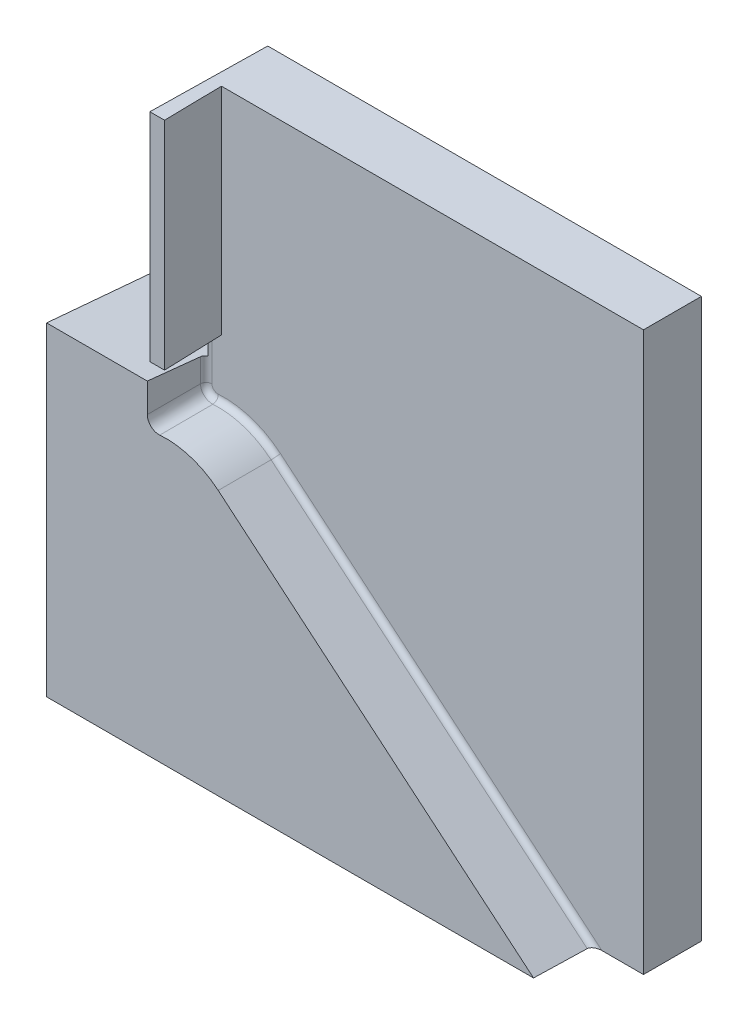
ISO-10303-21;
HEADER;
FILE_DESCRIPTION(('STEP AP214'),'2;1');
FILE_NAME('part.step','',(''),(''),'','','');
FILE_SCHEMA(('AUTOMOTIVE_DESIGN { 1 0 10303 214 1 1 1 1 }'));
ENDSEC;
DATA;
#1=APPLICATION_CONTEXT('core data for automotive mechanical design processes');
#2=APPLICATION_PROTOCOL_DEFINITION('international standard','automotive_design',2000,#1);
#3=PRODUCT_CONTEXT('',#1,'mechanical');
#4=PRODUCT('Part','Part','',(#3));
#5=PRODUCT_RELATED_PRODUCT_CATEGORY('part','',(#4));
#6=PRODUCT_DEFINITION_FORMATION('','',#4);
#7=PRODUCT_DEFINITION_CONTEXT('part definition',#1,'design');
#8=PRODUCT_DEFINITION('design','',#6,#7);
#9=PRODUCT_DEFINITION_SHAPE('','',#8);
#10=(LENGTH_UNIT() NAMED_UNIT(*) SI_UNIT(.MILLI.,.METRE.));
#11=(NAMED_UNIT(*) PLANE_ANGLE_UNIT() SI_UNIT($,.RADIAN.));
#12=(NAMED_UNIT(*) SI_UNIT($,.STERADIAN.) SOLID_ANGLE_UNIT());
#13=UNCERTAINTY_MEASURE_WITH_UNIT(LENGTH_MEASURE(1.E-05),#10,'distance_accuracy_value','');
#14=(GEOMETRIC_REPRESENTATION_CONTEXT(3) GLOBAL_UNCERTAINTY_ASSIGNED_CONTEXT((#13)) GLOBAL_UNIT_ASSIGNED_CONTEXT((#10,
#11,#12)) REPRESENTATION_CONTEXT('',''));
#15=CARTESIAN_POINT('',(0.,0.,0.));
#16=DIRECTION('',(0.,0.,1.));
#17=DIRECTION('',(1.,0.,0.));
#18=AXIS2_PLACEMENT_3D('',#15,#16,#17);
#19=CARTESIAN_POINT('',(0.,0.,10.));
#20=DIRECTION('',(0.,0.,1.));
#21=DIRECTION('',(1.,0.,0.));
#22=AXIS2_PLACEMENT_3D('',#19,#20,#21);
#23=PLANE('',#22);
#24=DIRECTION('',(-1.,0.,0.));
#25=VECTOR('',#24,1.);
#26=CARTESIAN_POINT('',(0.,10.4776428395734,10.));
#27=LINE('',#26,#25);
#28=CARTESIAN_POINT('',(-10.3127094384121,10.4776428395734,10.));
#29=VERTEX_POINT('',#28);
#30=CARTESIAN_POINT('',(-1.62,10.4776428395734,10.));
#31=VERTEX_POINT('',#30);
#32=EDGE_CURVE('E212',#29,#31,#27,.F.);
#33=ORIENTED_EDGE('',*,*,#32,.F.);
#34=DIRECTION('',(0.,-1.,0.));
#35=VECTOR('',#34,1.);
#36=CARTESIAN_POINT('',(-10.3127094384121,30.7179323600997,10.));
#37=LINE('',#36,#35);
#38=CARTESIAN_POINT('',(-10.3127094384121,-17.472327885701,10.));
#39=VERTEX_POINT('',#38);
#40=EDGE_CURVE('E367',#29,#39,#37,.T.);
#41=ORIENTED_EDGE('',*,*,#40,.T.);
#42=DIRECTION('',(1.,0.,0.));
#43=VECTOR('',#42,1.);
#44=CARTESIAN_POINT('',(-10.3127094384121,-17.472327885701,10.));
#45=LINE('',#44,#43);
#46=CARTESIAN_POINT('',(31.7127763167912,-17.472327885701,10.));
#47=VERTEX_POINT('',#46);
#48=EDGE_CURVE('E184',#39,#47,#45,.T.);
#49=ORIENTED_EDGE('',*,*,#48,.T.);
#50=DIRECTION('',(0.766044443118979,-0.642787609686538,0.));
#51=VECTOR('',#50,1.);
#52=CARTESIAN_POINT('',(4.49951326780577,5.36231110183286,10.));
#53=LINE('',#52,#51);
#54=CARTESIAN_POINT('',(4.49951326780577,5.36231110183285,10.));
#55=VERTEX_POINT('',#54);
#56=EDGE_CURVE('E208',#55,#47,#53,.T.);
#57=ORIENTED_EDGE('',*,*,#56,.F.);
#58=CARTESIAN_POINT('',(0.,0.,10.));
#59=DIRECTION('',(0.,0.,-1.));
#60=DIRECTION('',(1.,0.,0.));
#61=AXIS2_PLACEMENT_3D('',#58,#59,#60);
#62=CIRCLE('',#61,7.);
#63=CARTESIAN_POINT('',(-0.542643597644193,6.97893530031163,10.));
#64=VERTEX_POINT('',#63);
#65=EDGE_CURVE('E382',#64,#55,#62,.T.);
#66=ORIENTED_EDGE('',*,*,#65,.F.);
#67=CARTESIAN_POINT('',(-1.86226192819603,7.70949924589118,23.879176570944));
#68=CARTESIAN_POINT('',(-1.861881352247,6.59199390698618,23.8573733894266));
#69=CARTESIAN_POINT('',(-0.751260723548677,6.71584925175975,23.879176570944));
#70=CARTESIAN_POINT('',(-1.81468561428221,7.76269332908506,21.1535313722884));
#71=CARTESIAN_POINT('',(-1.81449061841132,6.65266247599894,21.1423600663269));
#72=CARTESIAN_POINT('',(-0.710497885203577,6.76828146759619,21.1535313722883));
#73=CARTESIAN_POINT('',(-1.76710911409322,7.81533916917287,18.4278755019356));
#74=CARTESIAN_POINT('',(-1.7669109798216,6.71279004661341,18.4165243971166));
#75=CARTESIAN_POINT('',(-0.66960984213034,6.82024975175268,18.4278755019355));
#76=CARTESIAN_POINT('',(-1.67195577395729,7.91959456815973,12.9765442965094));
#77=CARTESIAN_POINT('',(-1.67176669079631,6.8315467485382,12.965711729472));
#78=CARTESIAN_POINT('',(-0.587596004025211,6.92330304309015,12.9765442965093));
#79=CARTESIAN_POINT('',(-1.62437893401039,7.97120412719243,10.2508689614386));
#80=CARTESIAN_POINT('',(-1.62418589699077,6.89020664437266,10.2398098779916));
#81=CARTESIAN_POINT('',(-0.546470209023985,6.97438805038506,10.2508689614386));
#82=CARTESIAN_POINT('',(-1.52922493552314,8.07344718209033,4.7995000390909));
#83=CARTESIAN_POINT('',(-1.52903969228548,7.00612895866886,4.78888746111288));
#84=CARTESIAN_POINT('',(-0.463993514597806,7.07571938719937,4.79950003909091));
#85=CARTESIAN_POINT('',(-1.4816477769828,8.12408067796876,2.07380645181429));
#86=CARTESIAN_POINT('',(-1.48145944898192,7.06341879520625,2.06301714786963));
#87=CARTESIAN_POINT('',(-0.422642615175904,7.12596571673015,2.07380645181428));
#88=CARTESIAN_POINT('',(-1.38649315696092,8.2244237690955,-3.37759807822863));
#89=CARTESIAN_POINT('',(-1.38631168146097,7.17669363550962,-3.38799480265756));
#90=CARTESIAN_POINT('',(-0.33972707872638,7.22565877196112,-3.37759807822866));
#91=CARTESIAN_POINT('',(-1.33891569547934,8.27413336422466,-6.10330902099713));
#92=CARTESIAN_POINT('',(-1.33873046314048,7.2327032195496,-6.11392097458327));
#93=CARTESIAN_POINT('',(-0.298162441671193,7.27510549755819,-6.10330902099716));
#94=CARTESIAN_POINT('',(-1.29133809681156,8.32340708336826,-8.82902782315814));
#95=CARTESIAN_POINT('',(-1.29101157297209,7.28826937948639,-8.8477343613927));
#96=CARTESIAN_POINT('',(-0.256496624819869,7.32417195133359,-8.82902782315814));
#97=(BOUNDED_SURFACE() B_SPLINE_SURFACE(3,2,((#67,#68,#69),(#70,#71,#72),(#73,#74,#75),(#76,#77,
#78),(#79,#80,#81),(#82,#83,#84),(#85,#86,#87),(#88,#89,#90),(#91,#92,#93),(#94,#95,#96)),
.UNSPECIFIED.,.F.,.F.,.F.) B_SPLINE_SURFACE_WITH_KNOTS((4,2,2,2,4),(3,3),(0.,8.17973791160612,
16.3594747681815,24.5392115138579,32.7189493144313),(0.,1.),
.UNSPECIFIED.) GEOMETRIC_REPRESENTATION_ITEM() RATIONAL_B_SPLINE_SURFACE(((1.,0.666771327449439,
1.),(1.,0.669325498178683,1.),(1.,0.671818310341544,1.),(1.,0.676689481925855,1.),(1.,
0.679067841362067,1.),(1.,0.683718372507526,1.),(1.,0.685990544218211,1.),(1.,0.690435799295334,
1.),(1.,0.692608882648993,1.),(1.,0.694735971206638,1.))) REPRESENTATION_ITEM('') SURFACE());
#98=CARTESIAN_POINT('',(-0.542643597644193,6.97893530031163,10.));
#99=CARTESIAN_POINT('',(-0.570692909111427,6.9767545776183,10.));
#100=CARTESIAN_POINT('',(-0.598820842995149,6.97575871372237,10.));
#101=CARTESIAN_POINT('',(-0.655059370866384,6.97613825153809,10.));
#102=CARTESIAN_POINT('',(-0.683169965594433,6.97751354378452,10.));
#103=CARTESIAN_POINT('',(-0.767124084031438,6.98518977014603,10.));
#104=CARTESIAN_POINT('',(-0.822684918764359,6.99503376307722,10.));
#105=CARTESIAN_POINT('',(-0.931363695211913,7.02391035824553,10.));
#106=CARTESIAN_POINT('',(-0.98448044298687,7.04294740018397,10.));
#107=CARTESIAN_POINT('',(-1.08676348279268,7.08966883624479,10.));
#108=CARTESIAN_POINT('',(-1.13593032005199,7.11735203430202,10.));
#109=CARTESIAN_POINT('',(-1.22890789438271,7.18057638982659,10.));
#110=CARTESIAN_POINT('',(-1.27271945003591,7.21611634401076,10.));
#111=CARTESIAN_POINT('',(-1.35375663913103,7.29405036181978,10.));
#112=CARTESIAN_POINT('',(-1.39098189678914,7.33644481626689,10.));
#113=CARTESIAN_POINT('',(-1.45778182021727,7.42687646050034,10.));
#114=CARTESIAN_POINT('',(-1.48735715536757,7.47491315604646,10.));
#115=CARTESIAN_POINT('',(-1.53802464669529,7.57527163235374,10.));
#116=CARTESIAN_POINT('',(-1.55911754319833,7.6275930386763,10.));
#117=CARTESIAN_POINT('',(-1.59033560094408,7.72891957902586,10.));
#118=CARTESIAN_POINT('',(-1.60143325847842,7.77762794740184,10.));
#119=CARTESIAN_POINT('',(-1.61627820058463,7.87614369368367,10.));
#120=CARTESIAN_POINT('',(-1.62002658649893,7.92595090578822,10.));
#121=CARTESIAN_POINT('',(-1.62,7.97577421097765,10.));
#122=B_SPLINE_CURVE_WITH_KNOTS('',3,(#98,#99,#100,#101,#102,#103,#104,#105,#106,#107,#108,#109,
#110,#111,#112,#113,#114,#115,#116,#117,#118,#119,#120,#121),.UNSPECIFIED.,.F.,.F.,(4,2,2,2,2,2,
2,2,2,2,2,4),(0.,0.0843500560753299,0.168696218205322,0.337106410305261,0.505598016073043,
0.674066323887255,0.842508848183622,1.01096097993723,1.17939836687337,1.34782104983163,
1.49714458743473,1.64644574609613),.UNSPECIFIED.);
#123=CARTESIAN_POINT('',(-1.62,7.97577421097765,10.));
#124=VERTEX_POINT('',#123);
#125=EDGE_CURVE('E279',#64,#124,#122,.T.);
#126=ORIENTED_EDGE('',*,*,#125,.T.);
#127=DIRECTION('',(0.,-1.,0.));
#128=VECTOR('',#127,1.);
#129=CARTESIAN_POINT('',(-1.62,11.78,10.));
#130=LINE('',#129,#128);
#131=EDGE_CURVE('E203',#31,#124,#130,.T.);
#132=ORIENTED_EDGE('',*,*,#131,.F.);
#133=EDGE_LOOP('',(#33,#41,#49,#57,#66,#126,#132));
#134=FACE_BOUND('',#133,.T.);
#135=ADVANCED_FACE('F35',(#134),#23,.T.);
#136=CARTESIAN_POINT('',(36.1992830376344,30.7179323600997,10.));
#137=DIRECTION('',(-1.,0.,0.));
#138=DIRECTION('',(0.,0.,1.));
#139=AXIS2_PLACEMENT_3D('',#136,#137,#138);
#140=PLANE('',#139);
#141=DIRECTION('',(0.,1.,0.));
#142=VECTOR('',#141,1.);
#143=CARTESIAN_POINT('',(36.1992830376344,30.7179323600997,5.));
#144=LINE('',#143,#142);
#145=CARTESIAN_POINT('',(36.1992830376344,-17.472327885701,5.));
#146=VERTEX_POINT('',#145);
#147=CARTESIAN_POINT('',(36.1992830376344,30.7179323600997,5.));
#148=VERTEX_POINT('',#147);
#149=EDGE_CURVE('E151',#146,#148,#144,.T.);
#150=ORIENTED_EDGE('',*,*,#149,.F.);
#151=DIRECTION('',(0.,0.,-1.));
#152=VECTOR('',#151,1.);
#153=CARTESIAN_POINT('',(36.1992830376344,-17.472327885701,10.));
#154=LINE('',#153,#152);
#155=CARTESIAN_POINT('',(36.1992830376344,-17.472327885701,0.));
#156=VERTEX_POINT('',#155);
#157=EDGE_CURVE('E178',#146,#156,#154,.T.);
#158=ORIENTED_EDGE('',*,*,#157,.T.);
#159=DIRECTION('',(0.,1.,0.));
#160=VECTOR('',#159,1.);
#161=CARTESIAN_POINT('',(36.1992830376344,30.7179323600997,0.));
#162=LINE('',#161,#160);
#163=CARTESIAN_POINT('',(36.1992830376344,30.7179323600997,0.));
#164=VERTEX_POINT('',#163);
#165=EDGE_CURVE('E176',#156,#164,#162,.T.);
#166=ORIENTED_EDGE('',*,*,#165,.T.);
#167=DIRECTION('',(0.,0.,-1.));
#168=VECTOR('',#167,1.);
#169=CARTESIAN_POINT('',(36.1992830376344,30.7179323600997,10.));
#170=LINE('',#169,#168);
#171=EDGE_CURVE('E168',#148,#164,#170,.T.);
#172=ORIENTED_EDGE('',*,*,#171,.F.);
#173=EDGE_LOOP('',(#150,#158,#166,#172));
#174=FACE_BOUND('',#173,.T.);
#175=ADVANCED_FACE('F174',(#174),#140,.F.);
#176=CARTESIAN_POINT('',(-10.3127094384121,30.7179323600997,10.));
#177=DIRECTION('',(1.,0.,0.));
#178=DIRECTION('',(0.,0.,-1.));
#179=AXIS2_PLACEMENT_3D('',#176,#177,#178);
#180=PLANE('',#179);
#181=ORIENTED_EDGE('',*,*,#40,.F.);
#182=DIRECTION('',(0.,-0.0871557427476584,-0.996194698091746));
#183=VECTOR('',#182,1.);
#184=CARTESIAN_POINT('',(-10.3127094384121,11.58,22.6));
#185=LINE('',#184,#183);
#186=CARTESIAN_POINT('',(-10.3127094384121,9.60275620431411,0.));
#187=VERTEX_POINT('',#186);
#188=EDGE_CURVE('E215',#187,#29,#185,.F.);
#189=ORIENTED_EDGE('',*,*,#188,.F.);
#190=DIRECTION('',(0.,-1.,0.));
#191=VECTOR('',#190,1.);
#192=CARTESIAN_POINT('',(-10.3127094384121,30.7179323600997,0.));
#193=LINE('',#192,#191);
#194=CARTESIAN_POINT('',(-10.3127094384121,-17.472327885701,0.));
#195=VERTEX_POINT('',#194);
#196=EDGE_CURVE('E360',#187,#195,#193,.T.);
#197=ORIENTED_EDGE('',*,*,#196,.T.);
#198=DIRECTION('',(0.,0.,-1.));
#199=VECTOR('',#198,1.);
#200=CARTESIAN_POINT('',(-10.3127094384121,-17.472327885701,10.));
#201=LINE('',#200,#199);
#202=EDGE_CURVE('E181',#39,#195,#201,.T.);
#203=ORIENTED_EDGE('',*,*,#202,.F.);
#204=EDGE_LOOP('',(#181,#189,#197,#203));
#205=FACE_BOUND('',#204,.T.);
#206=ADVANCED_FACE('F334',(#205),#180,.F.);
#207=CARTESIAN_POINT('',(-10.3127094384121,-17.472327885701,10.));
#208=DIRECTION('',(0.,1.,0.));
#209=DIRECTION('',(0.,0.,1.));
#210=AXIS2_PLACEMENT_3D('',#207,#208,#209);
#211=PLANE('',#210);
#212=DIRECTION('',(1.,0.,0.));
#213=VECTOR('',#212,1.);
#214=CARTESIAN_POINT('',(-10.3127094384121,-17.472327885701,5.));
#215=LINE('',#214,#213);
#216=CARTESIAN_POINT('',(32.6129553922421,-17.472327885701,5.));
#217=VERTEX_POINT('',#216);
#218=EDGE_CURVE('E158',#217,#146,#215,.T.);
#219=ORIENTED_EDGE('',*,*,#218,.F.);
#220=CARTESIAN_POINT('',(32.6129553922421,-17.472327885701,5.5));
#221=DIRECTION('',(0.,1.,0.));
#222=DIRECTION('',(-1.,0.,0.));
#223=AXIS2_PLACEMENT_3D('',#220,#221,#222);
#224=ELLIPSE('',#223,0.777861913430208,0.5);
#225=CARTESIAN_POINT('',(31.835211950949,-17.472327885701,5.49127379678136));
#226=VERTEX_POINT('',#225);
#227=EDGE_CURVE('E11',#217,#226,#224,.T.);
#228=ORIENTED_EDGE('',*,*,#227,.T.);
#229=DIRECTION('',(0.02714525368675,0.,-0.999631499704907));
#230=VECTOR('',#229,1.);
#231=CARTESIAN_POINT('',(31.6818092157312,-17.472327885701,11.1403720897713));
#232=LINE('',#231,#230);
#233=EDGE_CURVE('E193',#226,#47,#232,.F.);
#234=ORIENTED_EDGE('',*,*,#233,.T.);
#235=ORIENTED_EDGE('',*,*,#48,.F.);
#236=ORIENTED_EDGE('',*,*,#202,.T.);
#237=DIRECTION('',(1.,0.,0.));
#238=VECTOR('',#237,1.);
#239=CARTESIAN_POINT('',(-10.3127094384121,-17.472327885701,0.));
#240=LINE('',#239,#238);
#241=EDGE_CURVE('E376',#195,#156,#240,.T.);
#242=ORIENTED_EDGE('',*,*,#241,.T.);
#243=ORIENTED_EDGE('',*,*,#157,.F.);
#244=EDGE_LOOP('',(#219,#228,#234,#235,#236,#242,#243));
#245=FACE_BOUND('',#244,.T.);
#246=ADVANCED_FACE('F347',(#245),#211,.F.);
#247=CARTESIAN_POINT('',(-10.3127094384121,30.7179323600997,10.));
#248=DIRECTION('',(0.,-1.,0.));
#249=DIRECTION('',(0.,0.,-1.));
#250=AXIS2_PLACEMENT_3D('',#247,#248,#249);
#251=PLANE('',#250);
#252=DIRECTION('',(-1.,0.,0.));
#253=VECTOR('',#252,1.);
#254=CARTESIAN_POINT('',(-10.3127094384121,30.7179323600997,0.));
#255=LINE('',#254,#253);
#256=CARTESIAN_POINT('',(-1.22551553262228,30.7179323600997,0.));
#257=VERTEX_POINT('',#256);
#258=EDGE_CURVE('E187',#164,#257,#255,.T.);
#259=ORIENTED_EDGE('',*,*,#258,.T.);
#260=DIRECTION('',(0.0174524064372835,0.,-0.999847695156391));
#261=VECTOR('',#260,1.);
#262=CARTESIAN_POINT('',(-1.40278085263461,30.7179323600997,10.1555233819705));
#263=LINE('',#262,#261);
#264=CARTESIAN_POINT('',(-1.40006618190446,30.7179323600997,10.));
#265=VERTEX_POINT('',#264);
#266=EDGE_CURVE('E217',#257,#265,#263,.F.);
#267=ORIENTED_EDGE('',*,*,#266,.T.);
#268=DIRECTION('',(-1.,0.,0.));
#269=VECTOR('',#268,1.);
#270=CARTESIAN_POINT('',(-10.3127094384121,30.7179323600997,10.));
#271=LINE('',#270,#269);
#272=CARTESIAN_POINT('',(-0.134843947951976,30.7179323600997,10.));
#273=VERTEX_POINT('',#272);
#274=EDGE_CURVE('E179',#273,#265,#271,.T.);
#275=ORIENTED_EDGE('',*,*,#274,.F.);
#276=DIRECTION('',(-0.0174524064372835,0.,-0.999847695156391));
#277=VECTOR('',#276,1.);
#278=CARTESIAN_POINT('',(0.12,30.7179323600997,24.6));
#279=LINE('',#278,#277);
#280=CARTESIAN_POINT('',(-0.222119272593065,30.7179323600997,5.));
#281=VERTEX_POINT('',#280);
#282=EDGE_CURVE('E171',#281,#273,#279,.F.);
#283=ORIENTED_EDGE('',*,*,#282,.F.);
#284=DIRECTION('',(-1.,0.,0.));
#285=VECTOR('',#284,1.);
#286=CARTESIAN_POINT('',(0.12,30.7179323600997,5.));
#287=LINE('',#286,#285);
#288=EDGE_CURVE('E156',#148,#281,#287,.T.);
#289=ORIENTED_EDGE('',*,*,#288,.F.);
#290=ORIENTED_EDGE('',*,*,#171,.T.);
#291=EDGE_LOOP('',(#259,#267,#275,#283,#289,#290));
#292=FACE_BOUND('',#291,.T.);
#293=ADVANCED_FACE('F167',(#292),#251,.F.);
#294=DIRECTION('',(0.,-1.,0.));
#295=VECTOR('',#294,1.);
#296=CARTESIAN_POINT('',(-1.40006618190446,0.,10.));
#297=LINE('',#296,#295);
#298=CARTESIAN_POINT('',(-1.40006618190446,12.034843947952,10.));
#299=VERTEX_POINT('',#298);
#300=EDGE_CURVE('E204',#299,#265,#297,.F.);
#301=ORIENTED_EDGE('',*,*,#300,.F.);
#302=DIRECTION('',(1.,0.,0.));
#303=VECTOR('',#302,1.);
#304=CARTESIAN_POINT('',(0.,12.034843947952,10.));
#305=LINE('',#304,#303);
#306=CARTESIAN_POINT('',(-0.134843947951977,12.034843947952,10.));
#307=VERTEX_POINT('',#306);
#308=EDGE_CURVE('E200',#307,#299,#305,.F.);
#309=ORIENTED_EDGE('',*,*,#308,.F.);
#310=DIRECTION('',(0.,1.,0.));
#311=VECTOR('',#310,1.);
#312=CARTESIAN_POINT('',(-0.134843947951977,0.,10.));
#313=LINE('',#312,#311);
#314=EDGE_CURVE('E205',#273,#307,#313,.F.);
#315=ORIENTED_EDGE('',*,*,#314,.F.);
#316=ORIENTED_EDGE('',*,*,#274,.T.);
#317=EDGE_LOOP('',(#301,#309,#315,#316));
#318=FACE_BOUND('',#317,.T.);
#319=ADVANCED_FACE('F330',(#318),#23,.T.);
#320=CARTESIAN_POINT('',(0.,0.,0.));
#321=DIRECTION('',(0.,0.,1.));
#322=DIRECTION('',(1.,0.,0.));
#323=AXIS2_PLACEMENT_3D('',#320,#321,#322);
#324=PLANE('',#323);
#325=ORIENTED_EDGE('',*,*,#196,.F.);
#326=DIRECTION('',(-1.,0.,0.));
#327=VECTOR('',#326,1.);
#328=CARTESIAN_POINT('',(0.,9.60275620431411,0.));
#329=LINE('',#328,#327);
#330=CARTESIAN_POINT('',(-1.22551553262228,9.60275620431411,0.));
#331=VERTEX_POINT('',#330);
#332=EDGE_CURVE('E218',#187,#331,#329,.F.);
#333=ORIENTED_EDGE('',*,*,#332,.T.);
#334=DIRECTION('',(0.,-1.,0.));
#335=VECTOR('',#334,1.);
#336=CARTESIAN_POINT('',(-1.22551553262228,0.,0.));
#337=LINE('',#336,#335);
#338=EDGE_CURVE('E221',#331,#257,#337,.F.);
#339=ORIENTED_EDGE('',*,*,#338,.T.);
#340=ORIENTED_EDGE('',*,*,#258,.F.);
#341=ORIENTED_EDGE('',*,*,#165,.F.);
#342=ORIENTED_EDGE('',*,*,#241,.F.);
#343=EDGE_LOOP('',(#325,#333,#339,#340,#341,#342));
#344=FACE_BOUND('',#343,.T.);
#345=ADVANCED_FACE('F340',(#344),#324,.F.);
#346=CARTESIAN_POINT('',(0.,0.,5.));
#347=DIRECTION('',(0.,0.,1.));
#348=DIRECTION('',(1.,0.,0.));
#349=AXIS2_PLACEMENT_3D('',#346,#347,#348);
#350=PLANE('',#349);
#351=DIRECTION('',(1.,0.,0.));
#352=VECTOR('',#351,1.);
#353=CARTESIAN_POINT('',(0.,12.1221192725931,5.));
#354=LINE('',#353,#352);
#355=CARTESIAN_POINT('',(-0.222119272593065,12.1221192725931,5.));
#356=VERTEX_POINT('',#355);
#357=CARTESIAN_POINT('',(-1.04137604380107,12.1221192725931,5.));
#358=VERTEX_POINT('',#357);
#359=EDGE_CURVE('E162',#356,#358,#354,.F.);
#360=ORIENTED_EDGE('',*,*,#359,.T.);
#361=DIRECTION('',(0.,1.,0.));
#362=VECTOR('',#361,1.);
#363=CARTESIAN_POINT('',(-1.04137604380107,0.,5.));
#364=LINE('',#363,#362);
#365=CARTESIAN_POINT('',(-1.04137604380107,8.0603823815696,5.));
#366=VERTEX_POINT('',#365);
#367=EDGE_CURVE('E401',#358,#366,#364,.F.);
#368=ORIENTED_EDGE('',*,*,#367,.T.);
#369=CARTESIAN_POINT('',(-1.01317516197914,8.22595449932483,5.));
#370=CARTESIAN_POINT('',(-1.48015486364908,8.38977384845094,5.));
#371=CARTESIAN_POINT('',(-1.48496065149075,8.39145974835932,5.49485440592619));
#372=CARTESIAN_POINT('',(-1.0225128882221,8.19940881898319,5.));
#373=CARTESIAN_POINT('',(-1.49810369731091,8.33678620204255,5.));
#374=CARTESIAN_POINT('',(-1.50362460347094,8.33838066609241,5.49419630543603));
#375=CARTESIAN_POINT('',(-1.02956398056225,8.17206836761446,5.));
#376=CARTESIAN_POINT('',(-1.51151101724132,8.2822927883085,5.));
#377=CARTESIAN_POINT('',(-1.51771573139799,8.28371157807334,5.4935632847072));
#378=CARTESIAN_POINT('',(-1.03899301374549,8.11661253428494,5.));
#379=CARTESIAN_POINT('',(-1.52906836022451,8.17197698057451,5.));
#380=CARTESIAN_POINT('',(-1.5365528629387,8.17282229174521,5.49236431144039));
#381=CARTESIAN_POINT('',(-1.04137433616704,8.08849772803923,5.));
#382=CARTESIAN_POINT('',(-1.53323715325577,8.11614989472573,5.));
#383=CARTESIAN_POINT('',(-1.54130562886124,8.116603245765,5.49179831064973));
#384=CARTESIAN_POINT('',(-1.04137775142649,8.03226717677011,5.));
#385=CARTESIAN_POINT('',(-1.53221272998726,8.00467254235568,5.));
#386=CARTESIAN_POINT('',(-1.54129415395882,8.0041617240809,5.49074928742545));
#387=CARTESIAN_POINT('',(-1.03899986824554,8.00415143175213,5.));
#388=CARTESIAN_POINT('',(-1.52702911947367,7.94901292179014,5.));
#389=CARTESIAN_POINT('',(-1.53652996108886,7.94793924839572,5.49026626457374));
#390=CARTESIAN_POINT('',(-1.02956002707422,7.94872365691294,5.));
#391=CARTESIAN_POINT('',(-1.50749969769503,7.83941816204229,5.));
#392=CARTESIAN_POINT('',(-1.51763508972678,7.83709993234049,5.4893969295428));
#393=CARTESIAN_POINT('',(-1.02249898131106,7.92141147164921,5.));
#394=CARTESIAN_POINT('',(-1.4931616132797,7.78547081425573,5.));
#395=CARTESIAN_POINT('',(-1.50350623536537,7.78248278143459,5.48901059854928));
#396=CARTESIAN_POINT('',(-1.0038967098633,7.86837512035762,5.));
#397=CARTESIAN_POINT('',(-1.45575781673588,7.68079495471118,5.));
#398=CARTESIAN_POINT('',(-1.46629009237052,7.67642248576823,5.4883456958125));
#399=CARTESIAN_POINT('',(-0.99235800442463,7.84265007043571,5.));
#400=CARTESIAN_POINT('',(-1.43269875362125,7.63005157515478,5.));
#401=CARTESIAN_POINT('',(-1.44320784314883,7.62497757435959,5.48806706362686));
#402=CARTESIAN_POINT('',(-0.965109069373972,7.79346792772104,5.));
#403=CARTESIAN_POINT('',(-1.37847147643014,7.53306669271103,5.));
#404=CARTESIAN_POINT('',(-1.38870224651184,7.52662155665903,5.4876248988889));
#405=CARTESIAN_POINT('',(-0.949393269387189,7.77001392088897,5.));
#406=CARTESIAN_POINT('',(-1.34728978134274,7.4868183472918,5.));
#407=CARTESIAN_POINT('',(-1.35726776096943,7.47971661945226,5.4874615211054));
#408=CARTESIAN_POINT('',(-0.914258983832495,7.72609929579733,5.));
#409=CARTESIAN_POINT('',(-1.27773086708173,7.40019837148088,5.));
#410=CARTESIAN_POINT('',(-1.28699558962725,7.39189121376182,5.48725516600131));
#411=CARTESIAN_POINT('',(-0.89484367668427,7.70563613443735,5.));
#412=CARTESIAN_POINT('',(-1.23935313415464,7.35981043507132,5.));
#413=CARTESIAN_POINT('',(-1.24816425881217,7.35096566104948,5.48721208582121));
#414=CARTESIAN_POINT('',(-0.8528527556091,7.66826029787023,5.));
#415=CARTESIAN_POINT('',(-1.15643990827063,7.2859639619472,5.));
#416=CARTESIAN_POINT('',(-1.16418303302008,7.27621334706147,5.48724729327283));
#417=CARTESIAN_POINT('',(-0.83027716647341,7.65134759481365,5.));
#418=CARTESIAN_POINT('',(-1.11189443993586,7.25249686950899,5.));
#419=CARTESIAN_POINT('',(-1.1190331876095,7.24238653010404,5.48732557995252));
#420=CARTESIAN_POINT('',(-0.782591597464218,7.62154259710789,5.));
#421=CARTESIAN_POINT('',(-1.01783343883505,7.1933883674863,5.));
#422=CARTESIAN_POINT('',(-1.02366686048595,7.1827713786369,5.48760137480258));
#423=CARTESIAN_POINT('',(-0.757479898151273,7.60865305464279,5.));
#424=CARTESIAN_POINT('',(-0.968302257905777,7.16774755191649,5.));
#425=CARTESIAN_POINT('',(-0.973446941357765,7.15698854690261,5.48779896431628));
#426=CARTESIAN_POINT('',(-0.705484407750519,7.58729213112669,5.));
#427=CARTESIAN_POINT('',(-0.865717618875263,7.12506636003997,5.));
#428=CARTESIAN_POINT('',(-0.869464847728752,7.11425722169682,5.48830750379013));
#429=CARTESIAN_POINT('',(-0.6786034291901,7.57881391998473,5.));
#430=CARTESIAN_POINT('',(-0.812656540279609,7.10801217929327,5.));
#431=CARTESIAN_POINT('',(-0.815708295279959,7.09729507113437,5.48861827723087));
#432=CARTESIAN_POINT('',(-0.627759021276471,7.56737421361888,5.));
#433=CARTESIAN_POINT('',(-0.712222170729522,7.08473939255321,5.));
#434=CARTESIAN_POINT('',(-0.71403123260311,7.07440307146948,5.48929180274087));
#435=CARTESIAN_POINT('',(-0.603932562414645,7.56379431089212,5.));
#436=CARTESIAN_POINT('',(-0.665116564735397,7.07731602929252,5.));
#437=CARTESIAN_POINT('',(-0.666384415537267,7.06723668874043,5.48964063467729));
#438=CARTESIAN_POINT('',(-0.556015329424252,7.56009241983703,5.));
#439=CARTESIAN_POINT('',(-0.570289308380773,7.0692358611231,5.));
#440=CARTESIAN_POINT('',(-0.570563346493463,7.05981859147874,5.490407443664));
#441=CARTESIAN_POINT('',(-0.531924592620807,7.55996994933361,5.));
#442=CARTESIAN_POINT('',(-0.52256079474395,7.06858264966347,5.));
#443=CARTESIAN_POINT('',(-0.522389168998882,7.05956591275792,5.49082541106444));
#444=CARTESIAN_POINT('',(-0.479917280931716,7.56346771055584,5.));
#445=CARTESIAN_POINT('',(-0.419384293334484,7.07456363353285,5.));
#446=CARTESIAN_POINT('',(-0.418391517087916,7.06654330857821,5.49179789062332));
#447=CARTESIAN_POINT('',(-0.452041622176478,7.56772345438495,5.));
#448=CARTESIAN_POINT('',(-0.363994649826316,7.08245600247601,5.));
#449=CARTESIAN_POINT('',(-0.362650068651486,7.07504418027582,5.4923635418994));
#450=CARTESIAN_POINT('',(-0.397336197766946,7.58084171052349,5.));
#451=CARTESIAN_POINT('',(-0.255091392078284,7.10735478667397,5.));
#452=CARTESIAN_POINT('',(-0.253260150384297,7.1012582439075,5.49356253193854));
#453=CARTESIAN_POINT('',(-0.370508718547738,7.58971374847961,5.));
#454=CARTESIAN_POINT('',(-0.201577111958323,7.12439248927607,5.));
#455=CARTESIAN_POINT('',(-0.199616255851675,7.1189904846598,5.49419600850303));
#456=CARTESIAN_POINT('',(-0.344635877512219,7.60081734848291,5.));
#457=CARTESIAN_POINT('',(-0.149886255704456,7.14586739204666,5.));
#458=CARTESIAN_POINT('',(-0.147882087360328,7.14118550207744,5.49485446473804));
#459=(BOUNDED_SURFACE() B_SPLINE_SURFACE(3,2,((#369,#370,#371),(#372,#373,#374),(#375,#376,
#377),(#378,#379,#380),(#381,#382,#383),(#384,#385,#386),(#387,#388,#389),(#390,#391,#392),
(#393,#394,#395),(#396,#397,#398),(#399,#400,#401),(#402,#403,#404),(#405,#406,#407),(#408,#409,
#410),(#411,#412,#413),(#414,#415,#416),(#417,#418,#419),(#420,#421,#422),(#423,#424,#425),
(#426,#427,#428),(#429,#430,#431),(#432,#433,#434),(#435,#436,#437),(#438,#439,#440),(#441,#442,
#443),(#444,#445,#446),(#447,#448,#449),(#450,#451,#452),(#453,#454,#455),(#456,#457,#458)),
.UNSPECIFIED.,.F.,.F.,.F.) B_SPLINE_SURFACE_WITH_KNOTS((4,2,2,2,2,2,2,2,2,2,2,2,2,2,4),(3,3),
(0.,0.0843084561355115,0.168555838364381,0.252802796080218,0.337033348257409,0.421216559962473,
0.505512602611673,0.589736546493942,0.673959829707248,0.758240603170488,0.842390492954846,
0.914428145054499,0.986455750700375,1.07064645781711,1.15501158410276),(0.,1.),
.UNSPECIFIED.) GEOMETRIC_REPRESENTATION_ITEM() RATIONAL_B_SPLINE_SURFACE(((1.,0.710735952336033,
1.),(1.,0.711198933035327,1.),(1.,0.711643798563658,1.),(1.,0.712485692637847,1.),(1.,
0.712882755603852,1.),(1.,0.713618139541195,1.),(1.,0.713956460808518,1.),(1.,0.714565016722317,
1.),(1.,0.714835264614575,1.),(1.,0.715300187858585,1.),(1.,0.715494905599342,1.),(1.,
0.71580383155137,1.),(1.,0.715917931505748,1.),(1.,0.716062036299479,1.),(1.,0.716092112982275,
1.),(1.,0.716067529589712,1.),(1.,0.716012870179043,1.),(1.,0.715820253384107,1.),(1.,
0.715682239166669,1.),(1.,0.715326867648427,1.),(1.,0.715109633896166,1.),(1.,0.714638541417748,
1.),(1.,0.71439445494589,1.),(1.,0.713857568794102,1.),(1.,0.713564775912519,1.),(1.,
0.712883050599966,1.),(1.,0.712486232672771,1.),(1.,0.711644327471939,1.),(1.,0.711199141901107,
1.),(1.,0.710735911309685,1.))) REPRESENTATION_ITEM('') SURFACE());
#460=CARTESIAN_POINT('',(-1.01317516197914,8.22595449932483,5.));
#461=CARTESIAN_POINT('',(-1.0225128882221,8.19940881898319,5.));
#462=CARTESIAN_POINT('',(-1.02956398056225,8.17206836761446,5.));
#463=CARTESIAN_POINT('',(-1.03899301374549,8.11661253428494,5.));
#464=CARTESIAN_POINT('',(-1.04137433616704,8.08849772803923,5.));
#465=CARTESIAN_POINT('',(-1.04137775142649,8.03226717677011,5.));
#466=CARTESIAN_POINT('',(-1.03899986824554,8.00415143175213,5.));
#467=CARTESIAN_POINT('',(-1.02956002707422,7.94872365691295,5.));
#468=CARTESIAN_POINT('',(-1.02249898131106,7.92141147164921,5.));
#469=CARTESIAN_POINT('',(-1.0038967098633,7.86837512035762,5.));
#470=CARTESIAN_POINT('',(-0.99235800442463,7.84265007043571,5.));
#471=CARTESIAN_POINT('',(-0.965109069373972,7.79346792772104,5.));
#472=CARTESIAN_POINT('',(-0.949393269387189,7.77001392088897,5.));
#473=CARTESIAN_POINT('',(-0.914258983832495,7.72609929579733,5.));
#474=CARTESIAN_POINT('',(-0.89484367668427,7.70563613443735,5.));
#475=CARTESIAN_POINT('',(-0.8528527556091,7.66826029787023,5.));
#476=CARTESIAN_POINT('',(-0.83027716647341,7.65134759481365,5.));
#477=CARTESIAN_POINT('',(-0.782591597464218,7.62154259710789,5.));
#478=CARTESIAN_POINT('',(-0.757479898151273,7.60865305464279,5.));
#479=CARTESIAN_POINT('',(-0.705484407750519,7.58729213112669,5.));
#480=CARTESIAN_POINT('',(-0.678603429190099,7.57881391998473,5.));
#481=CARTESIAN_POINT('',(-0.627759021276471,7.56737421361888,5.));
#482=CARTESIAN_POINT('',(-0.603932562414645,7.56379431089212,5.));
#483=CARTESIAN_POINT('',(-0.556015329424252,7.56009241983703,5.));
#484=CARTESIAN_POINT('',(-0.531924592620807,7.55996994933361,5.));
#485=CARTESIAN_POINT('',(-0.479917280931716,7.56346771055584,5.));
#486=CARTESIAN_POINT('',(-0.452041622176478,7.56772345438495,5.));
#487=CARTESIAN_POINT('',(-0.397336197766946,7.58084171052349,5.));
#488=CARTESIAN_POINT('',(-0.370508718547738,7.58971374847961,5.));
#489=CARTESIAN_POINT('',(-0.344635877512219,7.60081734848291,5.));
#490=B_SPLINE_CURVE_WITH_KNOTS('',3,(#460,#461,#462,#463,#464,#465,#466,#467,#468,#469,#470,
#471,#472,#473,#474,#475,#476,#477,#478,#479,#480,#481,#482,#483,#484,#485,#486,#487,#488,#489),
.UNSPECIFIED.,.F.,.F.,(4,2,2,2,2,2,2,2,2,2,2,2,2,2,4),(0.,0.0843084561355115,0.168555838364381,
0.252802796080218,0.337033348257409,0.421216559962473,0.505512602611673,0.589736546493942,
0.673959829707248,0.758240603170488,0.842390492954846,0.914428145054499,0.986455750700375,
1.07064645781711,1.15501158410276),.UNSPECIFIED.);
#491=CARTESIAN_POINT('',(-0.507945572038654,7.56158266273131,5.));
#492=VERTEX_POINT('',#491);
#493=EDGE_CURVE('E399',#366,#492,#490,.T.);
#494=ORIENTED_EDGE('',*,*,#493,.T.);
#495=CARTESIAN_POINT('',(0.,0.,5.));
#496=DIRECTION('',(0.,0.,1.));
#497=DIRECTION('',(1.,0.,0.));
#498=AXIS2_PLACEMENT_3D('',#495,#496,#497);
#499=CIRCLE('',#498,7.57862395619893);
#500=CARTESIAN_POINT('',(4.87144557751825,5.80556276813457,5.));
#501=VERTEX_POINT('',#500);
#502=EDGE_CURVE('E397',#492,#501,#499,.F.);
#503=ORIENTED_EDGE('',*,*,#502,.T.);
#504=DIRECTION('',(-0.766044443118979,0.642787609686538,0.));
#505=VECTOR('',#504,1.);
#506=CARTESIAN_POINT('',(4.87144557751825,5.80556276813457,5.));
#507=LINE('',#506,#505);
#508=EDGE_CURVE('E285',#501,#217,#507,.F.);
#509=ORIENTED_EDGE('',*,*,#508,.T.);
#510=ORIENTED_EDGE('',*,*,#218,.T.);
#511=ORIENTED_EDGE('',*,*,#149,.T.);
#512=ORIENTED_EDGE('',*,*,#288,.T.);
#513=DIRECTION('',(0.,1.,0.));
#514=VECTOR('',#513,1.);
#515=CARTESIAN_POINT('',(-0.222119272593065,0.,5.));
#516=LINE('',#515,#514);
#517=EDGE_CURVE('E172',#281,#356,#516,.F.);
#518=ORIENTED_EDGE('',*,*,#517,.T.);
#519=EDGE_LOOP('',(#360,#368,#494,#503,#509,#510,#511,#512,#518));
#520=FACE_BOUND('',#519,.T.);
#521=ADVANCED_FACE('F154',(#520),#350,.T.);
#522=CARTESIAN_POINT('',(4.49951326780577,5.36231110183286,10.));
#523=DIRECTION('',(0.642689710020171,0.765927770839873,0.0174524064372835));
#524=DIRECTION('',(-0.766044443118979,0.642787609686538,0.));
#525=AXIS2_PLACEMENT_3D('',#522,#523,#524);
#526=PLANE('',#525);
#527=ORIENTED_EDGE('',*,*,#233,.F.);
#528=DIRECTION('',(0.766044443118979,-0.642787609686538,0.));
#529=VECTOR('',#528,1.);
#530=CARTESIAN_POINT('',(4.55010072250816,5.42259888271463,5.49127379678136));
#531=LINE('',#530,#529);
#532=CARTESIAN_POINT('',(4.55010072250816,5.42259888271463,5.49127379678136));
#533=VERTEX_POINT('',#532);
#534=EDGE_CURVE('E420',#226,#533,#531,.F.);
#535=ORIENTED_EDGE('',*,*,#534,.T.);
#536=DIRECTION('',(0.0112181906170994,0.013369318970335,-0.999847695156391));
#537=VECTOR('',#536,1.);
#538=CARTESIAN_POINT('',(4.49951326780577,5.36231110183286,10.));
#539=LINE('',#538,#537);
#540=EDGE_CURVE('E196',#533,#55,#539,.F.);
#541=ORIENTED_EDGE('',*,*,#540,.T.);
#542=ORIENTED_EDGE('',*,*,#56,.T.);
#543=EDGE_LOOP('',(#527,#535,#541,#542));
#544=FACE_BOUND('',#543,.T.);
#545=ADVANCED_FACE('F258',(#544),#526,.T.);
#546=CARTESIAN_POINT('',(0.,11.78,24.6));
#547=DIRECTION('',(0.,-0.999847695156391,-0.0174524064372835));
#548=DIRECTION('',(0.,0.0174524064372835,-0.999847695156391));
#549=AXIS2_PLACEMENT_3D('',#546,#547,#548);
#550=PLANE('',#549);
#551=DIRECTION('',(-0.0174497491606827,-0.0174497491606827,0.999695459881887));
#552=VECTOR('',#551,1.);
#553=CARTESIAN_POINT('',(-1.62359756624139,11.811312563615,22.8061044319331));
#554=LINE('',#553,#552);
#555=CARTESIAN_POINT('',(-1.31420464347008,12.1207054863864,5.08099575753622));
#556=VERTEX_POINT('',#555);
#557=EDGE_CURVE('E198',#556,#299,#554,.T.);
#558=ORIENTED_EDGE('',*,*,#557,.F.);
#559=CARTESIAN_POINT('',(-1.04137604380107,12.113391740129,5.5));
#560=DIRECTION('',(0.,-0.999847695156391,-0.0174524064372835));
#561=DIRECTION('',(0.,0.0174524064372835,-0.999847695156391));
#562=AXIS2_PLACEMENT_3D('',#559,#560,#561);
#563=ELLIPSE('',#562,0.500076164021954,0.5);
#564=EDGE_CURVE('E411',#556,#358,#563,.T.);
#565=ORIENTED_EDGE('',*,*,#564,.T.);
#566=ORIENTED_EDGE('',*,*,#359,.F.);
#567=DIRECTION('',(0.0174497491606827,-0.0174497491606827,0.999695459881887));
#568=VECTOR('',#567,1.);
#569=CARTESIAN_POINT('',(0.119963460750508,11.7800365392495,24.5979066677986));
#570=LINE('',#569,#568);
#571=EDGE_CURVE('E195',#356,#307,#570,.T.);
#572=ORIENTED_EDGE('',*,*,#571,.T.);
#573=ORIENTED_EDGE('',*,*,#308,.T.);
#574=EDGE_LOOP('',(#558,#565,#566,#572,#573));
#575=FACE_BOUND('',#574,.T.);
#576=ADVANCED_FACE('F354',(#575),#550,.T.);
#577=CARTESIAN_POINT('',(0.12,0.,24.6));
#578=DIRECTION('',(0.999847695156391,0.,-0.0174524064372835));
#579=DIRECTION('',(-0.0174524064372835,0.,-0.999847695156391));
#580=AXIS2_PLACEMENT_3D('',#577,#578,#579);
#581=PLANE('',#580);
#582=ORIENTED_EDGE('',*,*,#314,.T.);
#583=ORIENTED_EDGE('',*,*,#571,.F.);
#584=ORIENTED_EDGE('',*,*,#517,.F.);
#585=ORIENTED_EDGE('',*,*,#282,.T.);
#586=EDGE_LOOP('',(#582,#583,#584,#585));
#587=FACE_BOUND('',#586,.T.);
#588=ADVANCED_FACE('F254',(#587),#581,.T.);
#589=CARTESIAN_POINT('',(0.,0.,10.));
#590=DIRECTION('',(0.,0.,-1.));
#591=DIRECTION('',(1.,0.,0.));
#592=AXIS2_PLACEMENT_3D('',#589,#590,#591);
#593=CONICAL_SURFACE('',#592,7.,0.0174532925199433);
#594=ORIENTED_EDGE('',*,*,#540,.F.);
#595=CARTESIAN_POINT('',(0.,0.,5.49127379678127));
#596=DIRECTION('',(0.,0.,1.));
#597=DIRECTION('',(1.,0.,0.));
#598=AXIS2_PLACEMENT_3D('',#595,#596,#597);
#599=CIRCLE('',#598,7.07870010862074);
#600=CARTESIAN_POINT('',(-0.474438947854436,7.06278294389301,5.49127379678136));
#601=VERTEX_POINT('',#600);
#602=EDGE_CURVE('E418',#533,#601,#599,.T.);
#603=ORIENTED_EDGE('',*,*,#602,.T.);
#604=CARTESIAN_POINT('',(-0.256496624819869,7.32417195133359,-8.82902782315814));
#605=CARTESIAN_POINT('',(-0.298162441671193,7.27510549755819,-6.10330902099716));
#606=CARTESIAN_POINT('',(-0.33972707872638,7.22565877196112,-3.37759807822866));
#607=CARTESIAN_POINT('',(-0.422642615175904,7.12596571673015,2.07380645181428));
#608=CARTESIAN_POINT('',(-0.463993514597806,7.07571938719937,4.79950003909091));
#609=CARTESIAN_POINT('',(-0.546470209023985,6.97438805038506,10.2508689614386));
#610=CARTESIAN_POINT('',(-0.587596004025211,6.92330304309015,12.9765442965093));
#611=CARTESIAN_POINT('',(-0.66960984213034,6.82024975175268,18.4278755019355));
#612=CARTESIAN_POINT('',(-0.710497885203577,6.76828146759619,21.1535313722883));
#613=CARTESIAN_POINT('',(-0.751260723548677,6.71584925175975,23.879176570944));
#614=B_SPLINE_CURVE_WITH_KNOTS('',3,(#604,#605,#606,#607,#608,#609,#610,#611,#612,#613),
.UNSPECIFIED.,.F.,.F.,(4,2,2,2,4),(0.,8.1797378005734,16.3594745462498,24.5392114028251,
32.7189493144313),.UNSPECIFIED.);
#615=EDGE_CURVE('E223',#601,#64,#614,.T.);
#616=ORIENTED_EDGE('',*,*,#615,.T.);
#617=ORIENTED_EDGE('',*,*,#65,.T.);
#618=EDGE_LOOP('',(#594,#603,#616,#617));
#619=FACE_BOUND('',#618,.T.);
#620=ADVANCED_FACE('F249',(#619),#593,.T.);
#621=CARTESIAN_POINT('',(-1.62,11.78,10.));
#622=DIRECTION('',(0.999847695156391,0.,0.0174524064372835));
#623=DIRECTION('',(0.0174524064372835,0.,-0.999847695156391));
#624=AXIS2_PLACEMENT_3D('',#621,#622,#623);
#625=PLANE('',#624);
#626=CARTESIAN_POINT('',(-1.86226192819603,7.70949924589118,23.879176570944));
#627=CARTESIAN_POINT('',(-1.81468561428221,7.76269332908506,21.1535313722884));
#628=CARTESIAN_POINT('',(-1.76710911409322,7.81533916917287,18.4278755019356));
#629=CARTESIAN_POINT('',(-1.67195577395729,7.91959456815973,12.9765442965094));
#630=CARTESIAN_POINT('',(-1.62437893401039,7.97120412719243,10.2508689614386));
#631=CARTESIAN_POINT('',(-1.52922493552314,8.07344718209033,4.7995000390909));
#632=CARTESIAN_POINT('',(-1.4816477769828,8.12408067796876,2.07380645181429));
#633=CARTESIAN_POINT('',(-1.38649315696092,8.2244237690955,-3.37759807822863));
#634=CARTESIAN_POINT('',(-1.33891569547934,8.27413336422466,-6.10330902099712));
#635=CARTESIAN_POINT('',(-1.29133809681156,8.32340708336826,-8.82902782315814));
#636=B_SPLINE_CURVE_WITH_KNOTS('',3,(#626,#627,#628,#629,#630,#631,#632,#633,#634,#635),
.UNSPECIFIED.,.F.,.F.,(4,2,2,2,4),(0.,8.17973791160612,16.3594747681815,24.5392115138579,
32.7189493144313),.UNSPECIFIED.);
#637=CARTESIAN_POINT('',(-1.54129989137926,8.06038238156961,5.49127379678136));
#638=VERTEX_POINT('',#637);
#639=EDGE_CURVE('E238',#124,#638,#636,.T.);
#640=ORIENTED_EDGE('',*,*,#639,.T.);
#641=DIRECTION('',(0.,-1.,0.));
#642=VECTOR('',#641,1.);
#643=CARTESIAN_POINT('',(-1.54129989137926,11.78,5.49127379678136));
#644=LINE('',#643,#642);
#645=CARTESIAN_POINT('',(-1.54129989137926,10.0831804098494,5.49127379678136));
#646=VERTEX_POINT('',#645);
#647=EDGE_CURVE('E409',#638,#646,#644,.F.);
#648=ORIENTED_EDGE('',*,*,#647,.T.);
#649=DIRECTION('',(-0.0173860148745836,0.0871425693158095,0.996044125076706));
#650=VECTOR('',#649,1.);
#651=CARTESIAN_POINT('',(-1.62197315185244,10.4875327150458,10.1130417939179));
#652=LINE('',#651,#650);
#653=EDGE_CURVE('E192',#646,#31,#652,.T.);
#654=ORIENTED_EDGE('',*,*,#653,.T.);
#655=ORIENTED_EDGE('',*,*,#131,.T.);
#656=EDGE_LOOP('',(#640,#648,#654,#655));
#657=FACE_BOUND('',#656,.T.);
#658=ADVANCED_FACE('F253',(#657),#625,.T.);
#659=CARTESIAN_POINT('',(0.,11.58,22.6));
#660=DIRECTION('',(0.,0.996194698091746,-0.0871557427476584));
#661=DIRECTION('',(0.,0.0871557427476584,0.996194698091746));
#662=AXIS2_PLACEMENT_3D('',#659,#660,#661);
#663=PLANE('',#662);
#664=ORIENTED_EDGE('',*,*,#32,.T.);
#665=ORIENTED_EDGE('',*,*,#653,.F.);
#666=CARTESIAN_POINT('',(-1.04137604380107,10.0839438537067,5.5));
#667=DIRECTION('',(0.,0.996194698091746,-0.0871557427476584));
#668=DIRECTION('',(0.,0.0871557427476584,0.996194698091746));
#669=AXIS2_PLACEMENT_3D('',#666,#667,#668);
#670=ELLIPSE('',#669,0.501909918771674,0.5);
#671=CARTESIAN_POINT('',(-1.31420464347008,10.0472857325218,5.08099575753622));
#672=VERTEX_POINT('',#671);
#673=EDGE_CURVE('E422',#646,#672,#670,.F.);
#674=ORIENTED_EDGE('',*,*,#673,.T.);
#675=DIRECTION('',(-0.0173860148745836,0.0871425693158095,0.996044125076706));
#676=VECTOR('',#675,1.);
#677=CARTESIAN_POINT('',(-1.61951031690859,11.5775455995497,22.5719460744816));
#678=LINE('',#677,#676);
#679=EDGE_CURVE('E52',#331,#672,#678,.T.);
#680=ORIENTED_EDGE('',*,*,#679,.F.);
#681=ORIENTED_EDGE('',*,*,#332,.F.);
#682=ORIENTED_EDGE('',*,*,#188,.T.);
#683=EDGE_LOOP('',(#664,#665,#674,#680,#681,#682));
#684=FACE_BOUND('',#683,.T.);
#685=ADVANCED_FACE('F363',(#684),#663,.T.);
#686=CARTESIAN_POINT('',(-1.62,0.,22.6));
#687=DIRECTION('',(-0.999847695156391,0.,-0.0174524064372835));
#688=DIRECTION('',(-0.0174524064372835,0.,0.999847695156391));
#689=AXIS2_PLACEMENT_3D('',#686,#687,#688);
#690=PLANE('',#689);
#691=ORIENTED_EDGE('',*,*,#300,.T.);
#692=ORIENTED_EDGE('',*,*,#266,.F.);
#693=ORIENTED_EDGE('',*,*,#338,.F.);
#694=ORIENTED_EDGE('',*,*,#679,.T.);
#695=DIRECTION('',(0.,1.,0.));
#696=VECTOR('',#695,1.);
#697=CARTESIAN_POINT('',(-1.31420464347008,10.0472857325218,5.08099575753622));
#698=LINE('',#697,#696);
#699=EDGE_CURVE('E44',#672,#556,#698,.T.);
#700=ORIENTED_EDGE('',*,*,#699,.T.);
#701=ORIENTED_EDGE('',*,*,#557,.T.);
#702=EDGE_LOOP('',(#691,#692,#693,#694,#700,#701));
#703=FACE_BOUND('',#702,.T.);
#704=ADVANCED_FACE('F266',(#703),#690,.T.);
#705=ORIENTED_EDGE('',*,*,#615,.F.);
#706=CARTESIAN_POINT('',(-0.147882087360328,7.14118550207744,5.49485446473804));
#707=CARTESIAN_POINT('',(-0.199616255851675,7.1189904846598,5.49419600850303));
#708=CARTESIAN_POINT('',(-0.253260150384297,7.1012582439075,5.49356253193854));
#709=CARTESIAN_POINT('',(-0.362650068651486,7.07504418027582,5.4923635418994));
#710=CARTESIAN_POINT('',(-0.418391517087916,7.06654330857821,5.49179789062332));
#711=CARTESIAN_POINT('',(-0.522389168998882,7.05956591275792,5.49082541106444));
#712=CARTESIAN_POINT('',(-0.570563346493462,7.05981859147874,5.490407443664));
#713=CARTESIAN_POINT('',(-0.666384415537267,7.06723668874043,5.48964063467729));
#714=CARTESIAN_POINT('',(-0.71403123260311,7.07440307146948,5.48929180274087));
#715=CARTESIAN_POINT('',(-0.815708295279959,7.09729507113437,5.48861827723087));
#716=CARTESIAN_POINT('',(-0.869464847728752,7.11425722169682,5.48830750379013));
#717=CARTESIAN_POINT('',(-0.973446941357765,7.15698854690261,5.48779896431628));
#718=CARTESIAN_POINT('',(-1.02366686048595,7.1827713786369,5.48760137480259));
#719=CARTESIAN_POINT('',(-1.1190331876095,7.24238653010404,5.48732557995252));
#720=CARTESIAN_POINT('',(-1.16418303302008,7.27621334706147,5.48724729327283));
#721=CARTESIAN_POINT('',(-1.24816425881217,7.35096566104948,5.48721208582121));
#722=CARTESIAN_POINT('',(-1.28699558962725,7.39189121376182,5.48725516600131));
#723=CARTESIAN_POINT('',(-1.35726776096943,7.47971661945226,5.4874615211054));
#724=CARTESIAN_POINT('',(-1.38870224651184,7.52662155665903,5.4876248988889));
#725=CARTESIAN_POINT('',(-1.44320784314883,7.62497757435959,5.48806706362686));
#726=CARTESIAN_POINT('',(-1.46629009237052,7.67642248576823,5.4883456958125));
#727=CARTESIAN_POINT('',(-1.50350623536537,7.78248278143459,5.48901059854928));
#728=CARTESIAN_POINT('',(-1.51763508972678,7.83709993234049,5.4893969295428));
#729=CARTESIAN_POINT('',(-1.53652996108886,7.94793924839572,5.49026626457374));
#730=CARTESIAN_POINT('',(-1.54129415395882,8.0041617240809,5.49074928742545));
#731=CARTESIAN_POINT('',(-1.54130562886124,8.116603245765,5.49179831064973));
#732=CARTESIAN_POINT('',(-1.5365528629387,8.17282229174521,5.49236431144039));
#733=CARTESIAN_POINT('',(-1.51771573139799,8.28371157807333,5.4935632847072));
#734=CARTESIAN_POINT('',(-1.50362460347094,8.33838066609241,5.49419630543603));
#735=CARTESIAN_POINT('',(-1.48496065149075,8.39145974835932,5.49485440592619));
#736=B_SPLINE_CURVE_WITH_KNOTS('',3,(#706,#707,#708,#709,#710,#711,#712,#713,#714,#715,#716,
#717,#718,#719,#720,#721,#722,#723,#724,#725,#726,#727,#728,#729,#730,#731,#732,#733,#734,#735),
.UNSPECIFIED.,.F.,.F.,(4,2,2,2,2,2,2,2,2,2,2,2,2,2,4),(0.,0.0843651262856476,0.168555833402384,
0.24058343904826,0.312621091147913,0.396770980932272,0.481051754395512,0.565275037608817,
0.649498981491086,0.733795024140287,0.81797823584535,0.902208788022542,0.986455745738379,
1.07070312796725,1.15501158410276),.UNSPECIFIED.);
#737=EDGE_CURVE('E396',#601,#638,#736,.T.);
#738=ORIENTED_EDGE('',*,*,#737,.T.);
#739=ORIENTED_EDGE('',*,*,#639,.F.);
#740=ORIENTED_EDGE('',*,*,#125,.F.);
#741=EDGE_LOOP('',(#705,#738,#739,#740));
#742=FACE_BOUND('',#741,.T.);
#743=ADVANCED_FACE('F261',(#742),#97,.F.);
#744=CARTESIAN_POINT('',(4.87144557751825,5.80556276813457,5.5));
#745=DIRECTION('',(-0.766044443118979,0.642787609686538,0.));
#746=DIRECTION('',(-0.642787609686538,-0.766044443118979,0.));
#747=AXIS2_PLACEMENT_3D('',#744,#745,#746);
#748=CYLINDRICAL_SURFACE('',#747,0.5);
#749=ORIENTED_EDGE('',*,*,#227,.F.);
#750=ORIENTED_EDGE('',*,*,#508,.F.);
#751=CARTESIAN_POINT('',(4.87144557751825,5.80556276813457,5.5));
#752=DIRECTION('',(0.766044443118979,-0.642787609686538,0.));
#753=DIRECTION('',(0.642787609686538,0.766044443118979,0.));
#754=AXIS2_PLACEMENT_3D('',#751,#752,#753);
#755=CIRCLE('',#754,0.5);
#756=EDGE_CURVE('E39',#533,#501,#755,.T.);
#757=ORIENTED_EDGE('',*,*,#756,.F.);
#758=ORIENTED_EDGE('',*,*,#534,.F.);
#759=EDGE_LOOP('',(#749,#750,#757,#758));
#760=FACE_BOUND('',#759,.T.);
#761=ADVANCED_FACE('F37',(#760),#748,.F.);
#762=CARTESIAN_POINT('',(0.,0.,5.5));
#763=DIRECTION('',(0.,0.,1.));
#764=DIRECTION('',(1.,0.,0.));
#765=AXIS2_PLACEMENT_3D('',#762,#763,#764);
#766=TOROIDAL_SURFACE('',#765,7.57862395619893,0.5);
#767=ORIENTED_EDGE('',*,*,#756,.T.);
#768=ORIENTED_EDGE('',*,*,#502,.F.);
#769=CARTESIAN_POINT('',(-0.507945572038654,7.56158266273131,5.5));
#770=DIRECTION('',(0.997751400047539,0.0670234563654765,0.));
#771=DIRECTION('',(-0.0670234563654765,0.99775140004754,0.));
#772=AXIS2_PLACEMENT_3D('',#769,#770,#771);
#773=CIRCLE('',#772,0.5);
#774=EDGE_CURVE('E314',#601,#492,#773,.T.);
#775=ORIENTED_EDGE('',*,*,#774,.F.);
#776=ORIENTED_EDGE('',*,*,#602,.F.);
#777=EDGE_LOOP('',(#767,#768,#775,#776));
#778=FACE_BOUND('',#777,.T.);
#779=ADVANCED_FACE('F302',(#778),#766,.F.);
#780=ORIENTED_EDGE('',*,*,#774,.T.);
#781=ORIENTED_EDGE('',*,*,#493,.F.);
#782=CARTESIAN_POINT('',(-1.04137604380107,8.06038238156964,5.49999999999993));
#783=DIRECTION('',(0.,-1.,0.));
#784=DIRECTION('',(1.,0.,0.));
#785=AXIS2_PLACEMENT_3D('',#782,#783,#784);
#786=CIRCLE('',#785,0.5);
#787=EDGE_CURVE('E424',#638,#366,#786,.T.);
#788=ORIENTED_EDGE('',*,*,#787,.F.);
#789=ORIENTED_EDGE('',*,*,#737,.F.);
#790=EDGE_LOOP('',(#780,#781,#788,#789));
#791=FACE_BOUND('',#790,.T.);
#792=ADVANCED_FACE('F296',(#791),#459,.F.);
#793=CARTESIAN_POINT('',(-1.04137604380107,0.,5.5));
#794=DIRECTION('',(0.,1.,0.));
#795=DIRECTION('',(-1.,0.,0.));
#796=AXIS2_PLACEMENT_3D('',#793,#794,#795);
#797=CYLINDRICAL_SURFACE('',#796,0.5);
#798=ORIENTED_EDGE('',*,*,#673,.F.);
#799=ORIENTED_EDGE('',*,*,#647,.F.);
#800=ORIENTED_EDGE('',*,*,#787,.T.);
#801=ORIENTED_EDGE('',*,*,#367,.F.);
#802=ORIENTED_EDGE('',*,*,#564,.F.);
#803=ORIENTED_EDGE('',*,*,#699,.F.);
#804=EDGE_LOOP('',(#798,#799,#800,#801,#802,#803));
#805=FACE_BOUND('',#804,.T.);
#806=ADVANCED_FACE('F301',(#805),#797,.F.);
#807=CLOSED_SHELL('',(#135,#175,#206,#246,#293,#319,#345,#521,#545,#576,#588,#620,#658,#685,
#704,#743,#761,#779,#792,#806));
#808=MANIFOLD_SOLID_BREP('B2',#807);
#809=ADVANCED_BREP_SHAPE_REPRESENTATION('',(#18,#808),#14);
#810=SHAPE_DEFINITION_REPRESENTATION(#9,#809);
ENDSEC;
END-ISO-10303-21;
